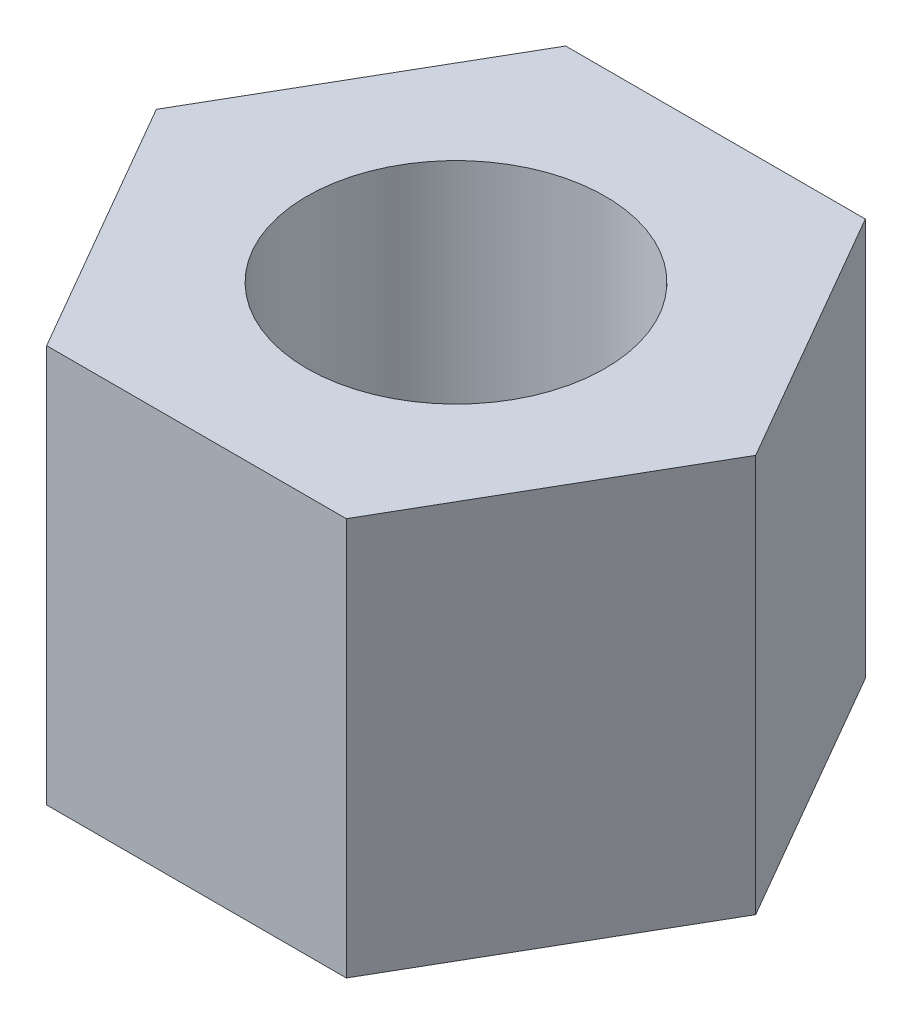
ISO-10303-21;
HEADER;
FILE_DESCRIPTION(('STEP AP214'),'2;1');
FILE_NAME('part.step','',(''),(''),'','','');
FILE_SCHEMA(('AUTOMOTIVE_DESIGN { 1 0 10303 214 1 1 1 1 }'));
ENDSEC;
DATA;
#1=APPLICATION_CONTEXT('core data for automotive mechanical design processes');
#2=APPLICATION_PROTOCOL_DEFINITION('international standard','automotive_design',2000,#1);
#3=PRODUCT_CONTEXT('',#1,'mechanical');
#4=PRODUCT('Part','Part','',(#3));
#5=PRODUCT_RELATED_PRODUCT_CATEGORY('part','',(#4));
#6=PRODUCT_DEFINITION_FORMATION('','',#4);
#7=PRODUCT_DEFINITION_CONTEXT('part definition',#1,'design');
#8=PRODUCT_DEFINITION('design','',#6,#7);
#9=PRODUCT_DEFINITION_SHAPE('','',#8);
#10=(LENGTH_UNIT() NAMED_UNIT(*) SI_UNIT(.MILLI.,.METRE.));
#11=(NAMED_UNIT(*) PLANE_ANGLE_UNIT() SI_UNIT($,.RADIAN.));
#12=(NAMED_UNIT(*) SI_UNIT($,.STERADIAN.) SOLID_ANGLE_UNIT());
#13=UNCERTAINTY_MEASURE_WITH_UNIT(LENGTH_MEASURE(1.E-05),#10,'distance_accuracy_value','');
#14=(GEOMETRIC_REPRESENTATION_CONTEXT(3) GLOBAL_UNCERTAINTY_ASSIGNED_CONTEXT((#13)) GLOBAL_UNIT_ASSIGNED_CONTEXT((#10,
#11,#12)) REPRESENTATION_CONTEXT('',''));
#15=CARTESIAN_POINT('',(0.,0.,0.));
#16=DIRECTION('',(0.,0.,1.));
#17=DIRECTION('',(1.,0.,0.));
#18=AXIS2_PLACEMENT_3D('',#15,#16,#17);
#19=CARTESIAN_POINT('',(0.,4.,0.));
#20=DIRECTION('',(0.,1.,0.));
#21=DIRECTION('',(0.,0.,1.));
#22=AXIS2_PLACEMENT_3D('',#19,#20,#21);
#23=PLANE('',#22);
#24=DIRECTION('',(0.499999999999995,0.,-0.866025403784441));
#25=VECTOR('',#24,1.);
#26=CARTESIAN_POINT('',(1.50672155762305,4.,2.60971829066237));
#27=LINE('',#26,#25);
#28=CARTESIAN_POINT('',(1.50672155762305,4.,2.60971829066237));
#29=VERTEX_POINT('',#28);
#30=CARTESIAN_POINT('',(3.01344311524604,4.,0.));
#31=VERTEX_POINT('',#30);
#32=EDGE_CURVE('E131',#29,#31,#27,.T.);
#33=ORIENTED_EDGE('',*,*,#32,.T.);
#34=DIRECTION('',(-0.500000000000001,0.,-0.866025403784438));
#35=VECTOR('',#34,1.);
#36=CARTESIAN_POINT('',(3.01344311524604,4.,0.));
#37=LINE('',#36,#35);
#38=CARTESIAN_POINT('',(1.50672155762301,4.,-2.60971829066239));
#39=VERTEX_POINT('',#38);
#40=EDGE_CURVE('E89',#31,#39,#37,.T.);
#41=ORIENTED_EDGE('',*,*,#40,.T.);
#42=DIRECTION('',(-1.,0.,0.));
#43=VECTOR('',#42,1.);
#44=CARTESIAN_POINT('',(1.50672155762301,4.,-2.60971829066239));
#45=LINE('',#44,#43);
#46=CARTESIAN_POINT('',(-1.50672155762303,4.,-2.60971829066238));
#47=VERTEX_POINT('',#46);
#48=EDGE_CURVE('E102',#39,#47,#45,.T.);
#49=ORIENTED_EDGE('',*,*,#48,.T.);
#50=DIRECTION('',(-0.499999999999995,0.,0.866025403784442));
#51=VECTOR('',#50,1.);
#52=CARTESIAN_POINT('',(-1.50672155762303,4.,-2.60971829066238));
#53=LINE('',#52,#51);
#54=CARTESIAN_POINT('',(-3.01344311524604,4.,0.));
#55=VERTEX_POINT('',#54);
#56=EDGE_CURVE('E96',#47,#55,#53,.T.);
#57=ORIENTED_EDGE('',*,*,#56,.T.);
#58=DIRECTION('',(0.500000000000007,0.,0.866025403784434));
#59=VECTOR('',#58,1.);
#60=CARTESIAN_POINT('',(-3.01344311524604,4.,0.));
#61=LINE('',#60,#59);
#62=CARTESIAN_POINT('',(-1.506721557623,4.,2.6097182906624));
#63=VERTEX_POINT('',#62);
#64=EDGE_CURVE('E100',#55,#63,#61,.T.);
#65=ORIENTED_EDGE('',*,*,#64,.T.);
#66=DIRECTION('',(1.,0.,0.));
#67=VECTOR('',#66,1.);
#68=CARTESIAN_POINT('',(-1.506721557623,4.,2.6097182906624));
#69=LINE('',#68,#67);
#70=EDGE_CURVE('E52',#63,#29,#69,.T.);
#71=ORIENTED_EDGE('',*,*,#70,.T.);
#72=EDGE_LOOP('',(#33,#41,#49,#57,#65,#71));
#73=FACE_BOUND('',#72,.T.);
#74=CARTESIAN_POINT('',(0.,4.,0.));
#75=DIRECTION('',(0.,1.,0.));
#76=DIRECTION('',(0.,0.,1.));
#77=AXIS2_PLACEMENT_3D('',#74,#75,#76);
#78=CIRCLE('',#77,1.5);
#79=CARTESIAN_POINT('',(0.,4.,1.5));
#80=VERTEX_POINT('',#79);
#81=EDGE_CURVE('E124',#80,#80,#78,.T.);
#82=ORIENTED_EDGE('',*,*,#81,.F.);
#83=EDGE_LOOP('',(#82));
#84=FACE_BOUND('',#83,.T.);
#85=ADVANCED_FACE('F35',(#73,#84),#23,.T.);
#86=CARTESIAN_POINT('',(0.,0.,0.));
#87=DIRECTION('',(0.,1.,0.));
#88=DIRECTION('',(0.,0.,1.));
#89=AXIS2_PLACEMENT_3D('',#86,#87,#88);
#90=PLANE('',#89);
#91=DIRECTION('',(0.499999999999995,0.,-0.866025403784441));
#92=VECTOR('',#91,1.);
#93=CARTESIAN_POINT('',(1.50672155762305,0.,2.60971829066237));
#94=LINE('',#93,#92);
#95=CARTESIAN_POINT('',(1.50672155762305,0.,2.60971829066237));
#96=VERTEX_POINT('',#95);
#97=CARTESIAN_POINT('',(3.01344311524604,0.,0.));
#98=VERTEX_POINT('',#97);
#99=EDGE_CURVE('E120',#96,#98,#94,.T.);
#100=ORIENTED_EDGE('',*,*,#99,.F.);
#101=DIRECTION('',(1.,0.,0.));
#102=VECTOR('',#101,1.);
#103=CARTESIAN_POINT('',(-1.506721557623,0.,2.6097182906624));
#104=LINE('',#103,#102);
#105=CARTESIAN_POINT('',(-1.506721557623,0.,2.6097182906624));
#106=VERTEX_POINT('',#105);
#107=EDGE_CURVE('E81',#106,#96,#104,.T.);
#108=ORIENTED_EDGE('',*,*,#107,.F.);
#109=DIRECTION('',(0.500000000000007,0.,0.866025403784434));
#110=VECTOR('',#109,1.);
#111=CARTESIAN_POINT('',(-3.01344311524604,0.,0.));
#112=LINE('',#111,#110);
#113=CARTESIAN_POINT('',(-3.01344311524604,0.,0.));
#114=VERTEX_POINT('',#113);
#115=EDGE_CURVE('E75',#114,#106,#112,.T.);
#116=ORIENTED_EDGE('',*,*,#115,.F.);
#117=DIRECTION('',(-0.499999999999995,0.,0.866025403784442));
#118=VECTOR('',#117,1.);
#119=CARTESIAN_POINT('',(-1.50672155762303,0.,-2.60971829066238));
#120=LINE('',#119,#118);
#121=CARTESIAN_POINT('',(-1.50672155762303,0.,-2.60971829066238));
#122=VERTEX_POINT('',#121);
#123=EDGE_CURVE('E110',#122,#114,#120,.T.);
#124=ORIENTED_EDGE('',*,*,#123,.F.);
#125=DIRECTION('',(-1.,0.,0.));
#126=VECTOR('',#125,1.);
#127=CARTESIAN_POINT('',(1.50672155762301,0.,-2.60971829066239));
#128=LINE('',#127,#126);
#129=CARTESIAN_POINT('',(1.50672155762301,0.,-2.60971829066239));
#130=VERTEX_POINT('',#129);
#131=EDGE_CURVE('E126',#130,#122,#128,.T.);
#132=ORIENTED_EDGE('',*,*,#131,.F.);
#133=DIRECTION('',(-0.500000000000001,0.,-0.866025403784438));
#134=VECTOR('',#133,1.);
#135=CARTESIAN_POINT('',(3.01344311524604,0.,0.));
#136=LINE('',#135,#134);
#137=EDGE_CURVE('E123',#98,#130,#136,.T.);
#138=ORIENTED_EDGE('',*,*,#137,.F.);
#139=EDGE_LOOP('',(#100,#108,#116,#124,#132,#138));
#140=FACE_BOUND('',#139,.T.);
#141=CARTESIAN_POINT('',(0.,0.,0.));
#142=DIRECTION('',(0.,1.,0.));
#143=DIRECTION('',(0.,0.,1.));
#144=AXIS2_PLACEMENT_3D('',#141,#142,#143);
#145=CIRCLE('',#144,1.5);
#146=CARTESIAN_POINT('',(0.,0.,1.5));
#147=VERTEX_POINT('',#146);
#148=EDGE_CURVE('E224',#147,#147,#145,.T.);
#149=ORIENTED_EDGE('',*,*,#148,.T.);
#150=EDGE_LOOP('',(#149));
#151=FACE_BOUND('',#150,.T.);
#152=ADVANCED_FACE('F140',(#140,#151),#90,.F.);
#153=CARTESIAN_POINT('',(1.50672155762305,4.,2.60971829066237));
#154=DIRECTION('',(-0.866025403784441,0.,-0.499999999999995));
#155=DIRECTION('',(-0.499999999999995,0.,0.866025403784442));
#156=AXIS2_PLACEMENT_3D('',#153,#154,#155);
#157=PLANE('',#156);
#158=ORIENTED_EDGE('',*,*,#99,.T.);
#159=DIRECTION('',(0.,-1.,0.));
#160=VECTOR('',#159,1.);
#161=CARTESIAN_POINT('',(3.01344311524604,4.,0.));
#162=LINE('',#161,#160);
#163=EDGE_CURVE('E11',#31,#98,#162,.T.);
#164=ORIENTED_EDGE('',*,*,#163,.F.);
#165=ORIENTED_EDGE('',*,*,#32,.F.);
#166=DIRECTION('',(0.,-1.,0.));
#167=VECTOR('',#166,1.);
#168=CARTESIAN_POINT('',(1.50672155762305,4.,2.60971829066237));
#169=LINE('',#168,#167);
#170=EDGE_CURVE('E116',#29,#96,#169,.T.);
#171=ORIENTED_EDGE('',*,*,#170,.T.);
#172=EDGE_LOOP('',(#158,#164,#165,#171));
#173=FACE_BOUND('',#172,.T.);
#174=ADVANCED_FACE('F37',(#173),#157,.F.);
#175=CARTESIAN_POINT('',(3.01344311524604,4.,0.));
#176=DIRECTION('',(-0.866025403784438,0.,0.500000000000001));
#177=DIRECTION('',(0.500000000000001,0.,0.866025403784438));
#178=AXIS2_PLACEMENT_3D('',#175,#176,#177);
#179=PLANE('',#178);
#180=ORIENTED_EDGE('',*,*,#137,.T.);
#181=DIRECTION('',(0.,-1.,0.));
#182=VECTOR('',#181,1.);
#183=CARTESIAN_POINT('',(1.50672155762301,4.,-2.60971829066239));
#184=LINE('',#183,#182);
#185=EDGE_CURVE('E44',#39,#130,#184,.T.);
#186=ORIENTED_EDGE('',*,*,#185,.F.);
#187=ORIENTED_EDGE('',*,*,#40,.F.);
#188=ORIENTED_EDGE('',*,*,#163,.T.);
#189=EDGE_LOOP('',(#180,#186,#187,#188));
#190=FACE_BOUND('',#189,.T.);
#191=ADVANCED_FACE('F165',(#190),#179,.F.);
#192=CARTESIAN_POINT('',(1.50672155762301,4.,-2.60971829066239));
#193=DIRECTION('',(0.,0.,1.));
#194=DIRECTION('',(1.,0.,0.));
#195=AXIS2_PLACEMENT_3D('',#192,#193,#194);
#196=PLANE('',#195);
#197=ORIENTED_EDGE('',*,*,#131,.T.);
#198=DIRECTION('',(0.,-1.,0.));
#199=VECTOR('',#198,1.);
#200=CARTESIAN_POINT('',(-1.50672155762303,4.,-2.60971829066238));
#201=LINE('',#200,#199);
#202=EDGE_CURVE('E111',#47,#122,#201,.T.);
#203=ORIENTED_EDGE('',*,*,#202,.F.);
#204=ORIENTED_EDGE('',*,*,#48,.F.);
#205=ORIENTED_EDGE('',*,*,#185,.T.);
#206=EDGE_LOOP('',(#197,#203,#204,#205));
#207=FACE_BOUND('',#206,.T.);
#208=ADVANCED_FACE('F137',(#207),#196,.F.);
#209=CARTESIAN_POINT('',(-1.50672155762303,4.,-2.60971829066238));
#210=DIRECTION('',(0.866025403784442,0.,0.499999999999995));
#211=DIRECTION('',(0.499999999999995,0.,-0.866025403784442));
#212=AXIS2_PLACEMENT_3D('',#209,#210,#211);
#213=PLANE('',#212);
#214=ORIENTED_EDGE('',*,*,#123,.T.);
#215=DIRECTION('',(0.,-1.,0.));
#216=VECTOR('',#215,1.);
#217=CARTESIAN_POINT('',(-3.01344311524604,4.,0.));
#218=LINE('',#217,#216);
#219=EDGE_CURVE('E107',#55,#114,#218,.T.);
#220=ORIENTED_EDGE('',*,*,#219,.F.);
#221=ORIENTED_EDGE('',*,*,#56,.F.);
#222=ORIENTED_EDGE('',*,*,#202,.T.);
#223=EDGE_LOOP('',(#214,#220,#221,#222));
#224=FACE_BOUND('',#223,.T.);
#225=ADVANCED_FACE('F108',(#224),#213,.F.);
#226=CARTESIAN_POINT('',(-3.01344311524604,4.,0.));
#227=DIRECTION('',(0.866025403784435,0.,-0.500000000000007));
#228=DIRECTION('',(-0.500000000000007,0.,-0.866025403784434));
#229=AXIS2_PLACEMENT_3D('',#226,#227,#228);
#230=PLANE('',#229);
#231=ORIENTED_EDGE('',*,*,#115,.T.);
#232=DIRECTION('',(0.,-1.,0.));
#233=VECTOR('',#232,1.);
#234=CARTESIAN_POINT('',(-1.506721557623,4.,2.6097182906624));
#235=LINE('',#234,#233);
#236=EDGE_CURVE('E112',#63,#106,#235,.T.);
#237=ORIENTED_EDGE('',*,*,#236,.F.);
#238=ORIENTED_EDGE('',*,*,#64,.F.);
#239=ORIENTED_EDGE('',*,*,#219,.T.);
#240=EDGE_LOOP('',(#231,#237,#238,#239));
#241=FACE_BOUND('',#240,.T.);
#242=ADVANCED_FACE('F114',(#241),#230,.F.);
#243=CARTESIAN_POINT('',(-1.506721557623,4.,2.6097182906624));
#244=DIRECTION('',(0.,0.,-1.));
#245=DIRECTION('',(-1.,0.,0.));
#246=AXIS2_PLACEMENT_3D('',#243,#244,#245);
#247=PLANE('',#246);
#248=ORIENTED_EDGE('',*,*,#107,.T.);
#249=ORIENTED_EDGE('',*,*,#170,.F.);
#250=ORIENTED_EDGE('',*,*,#70,.F.);
#251=ORIENTED_EDGE('',*,*,#236,.T.);
#252=EDGE_LOOP('',(#248,#249,#250,#251));
#253=FACE_BOUND('',#252,.T.);
#254=ADVANCED_FACE('F145',(#253),#247,.F.);
#255=CARTESIAN_POINT('',(0.,4.,0.));
#256=DIRECTION('',(0.,-1.,0.));
#257=DIRECTION('',(0.,0.,-1.));
#258=AXIS2_PLACEMENT_3D('',#255,#256,#257);
#259=CYLINDRICAL_SURFACE('',#258,1.5);
#260=ORIENTED_EDGE('',*,*,#81,.T.);
#261=EDGE_LOOP('',(#260));
#262=FACE_BOUND('',#261,.T.);
#263=ORIENTED_EDGE('',*,*,#148,.F.);
#264=EDGE_LOOP('',(#263));
#265=FACE_BOUND('',#264,.T.);
#266=ADVANCED_FACE('F147',(#262,#265),#259,.F.);
#267=CLOSED_SHELL('',(#85,#152,#174,#191,#208,#225,#242,#254,#266));
#268=MANIFOLD_SOLID_BREP('B2',#267);
#269=ADVANCED_BREP_SHAPE_REPRESENTATION('',(#18,#268),#14);
#270=SHAPE_DEFINITION_REPRESENTATION(#9,#269);
ENDSEC;
END-ISO-10303-21;
